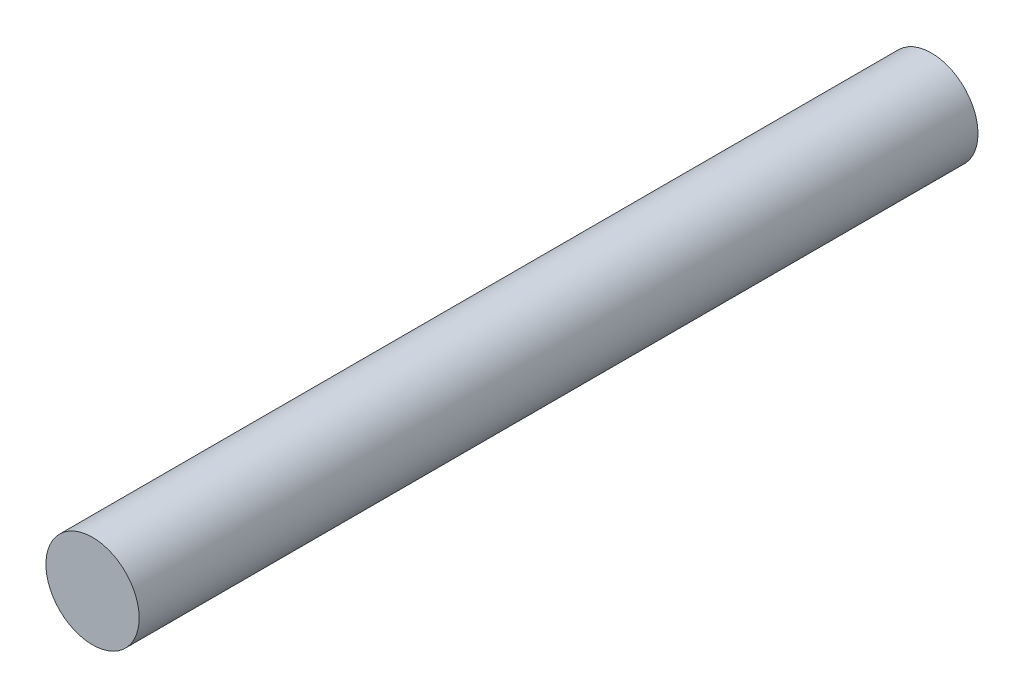
ISO-10303-21;
HEADER;
FILE_DESCRIPTION(('STEP AP214'),'2;1');
FILE_NAME('part.step','',(''),(''),'','','');
FILE_SCHEMA(('AUTOMOTIVE_DESIGN { 1 0 10303 214 1 1 1 1 }'));
ENDSEC;
DATA;
#1=APPLICATION_CONTEXT('core data for automotive mechanical design processes');
#2=APPLICATION_PROTOCOL_DEFINITION('international standard','automotive_design',2000,#1);
#3=PRODUCT_CONTEXT('',#1,'mechanical');
#4=PRODUCT('Part','Part','',(#3));
#5=PRODUCT_RELATED_PRODUCT_CATEGORY('part','',(#4));
#6=PRODUCT_DEFINITION_FORMATION('','',#4);
#7=PRODUCT_DEFINITION_CONTEXT('part definition',#1,'design');
#8=PRODUCT_DEFINITION('design','',#6,#7);
#9=PRODUCT_DEFINITION_SHAPE('','',#8);
#10=(LENGTH_UNIT() NAMED_UNIT(*) SI_UNIT(.MILLI.,.METRE.));
#11=(NAMED_UNIT(*) PLANE_ANGLE_UNIT() SI_UNIT($,.RADIAN.));
#12=(NAMED_UNIT(*) SI_UNIT($,.STERADIAN.) SOLID_ANGLE_UNIT());
#13=UNCERTAINTY_MEASURE_WITH_UNIT(LENGTH_MEASURE(1.E-05),#10,'distance_accuracy_value','');
#14=(GEOMETRIC_REPRESENTATION_CONTEXT(3) GLOBAL_UNCERTAINTY_ASSIGNED_CONTEXT((#13)) GLOBAL_UNIT_ASSIGNED_CONTEXT((#10,
#11,#12)) REPRESENTATION_CONTEXT('',''));
#15=CARTESIAN_POINT('',(0.,0.,0.));
#16=DIRECTION('',(0.,0.,1.));
#17=DIRECTION('',(1.,0.,0.));
#18=AXIS2_PLACEMENT_3D('',#15,#16,#17);
#19=CARTESIAN_POINT('',(1.526,3.899,-9.1));
#20=DIRECTION('',(0.,0.,-1.));
#21=DIRECTION('',(-1.,0.,0.));
#22=AXIS2_PLACEMENT_3D('',#19,#20,#21);
#23=PLANE('',#22);
#24=CARTESIAN_POINT('',(1.225,4.2,-9.1));
#25=DIRECTION('',(0.,0.,1.));
#26=DIRECTION('',(1.,0.,0.));
#27=AXIS2_PLACEMENT_3D('',#24,#25,#26);
#28=CIRCLE('',#27,0.3);
#29=CARTESIAN_POINT('',(1.525,4.2,-9.1));
#30=VERTEX_POINT('',#29);
#31=EDGE_CURVE('E19',#30,#30,#28,.T.);
#32=ORIENTED_EDGE('',*,*,#31,.F.);
#33=EDGE_LOOP('',(#32));
#34=FACE_BOUND('',#33,.T.);
#35=ADVANCED_FACE('F15',(#34),#23,.T.);
#36=CARTESIAN_POINT('',(1.225,4.2,-9.1));
#37=DIRECTION('',(0.,0.,1.));
#38=DIRECTION('',(1.,0.,0.));
#39=AXIS2_PLACEMENT_3D('',#36,#37,#38);
#40=CYLINDRICAL_SURFACE('',#39,0.3);
#41=CARTESIAN_POINT('',(1.225,4.2,-3.7));
#42=DIRECTION('',(0.,0.,1.));
#43=DIRECTION('',(1.,0.,0.));
#44=AXIS2_PLACEMENT_3D('',#41,#42,#43);
#45=CIRCLE('',#44,0.3);
#46=CARTESIAN_POINT('',(1.525,4.2,-3.7));
#47=VERTEX_POINT('',#46);
#48=EDGE_CURVE('E10',#47,#47,#45,.T.);
#49=ORIENTED_EDGE('',*,*,#48,.F.);
#50=EDGE_LOOP('',(#49));
#51=FACE_BOUND('',#50,.T.);
#52=ORIENTED_EDGE('',*,*,#31,.T.);
#53=EDGE_LOOP('',(#52));
#54=FACE_BOUND('',#53,.T.);
#55=ADVANCED_FACE('F28',(#51,#54),#40,.T.);
#56=CARTESIAN_POINT('',(1.526,4.501,-3.7));
#57=DIRECTION('',(0.,0.,1.));
#58=DIRECTION('',(-1.,0.,0.));
#59=AXIS2_PLACEMENT_3D('',#56,#57,#58);
#60=PLANE('',#59);
#61=ORIENTED_EDGE('',*,*,#48,.T.);
#62=EDGE_LOOP('',(#61));
#63=FACE_BOUND('',#62,.T.);
#64=ADVANCED_FACE('F17',(#63),#60,.T.);
#65=CLOSED_SHELL('',(#35,#55,#64));
#66=MANIFOLD_SOLID_BREP('B1',#65);
#67=ADVANCED_BREP_SHAPE_REPRESENTATION('',(#18,#66),#14);
#68=SHAPE_DEFINITION_REPRESENTATION(#9,#67);
ENDSEC;
END-ISO-10303-21;
